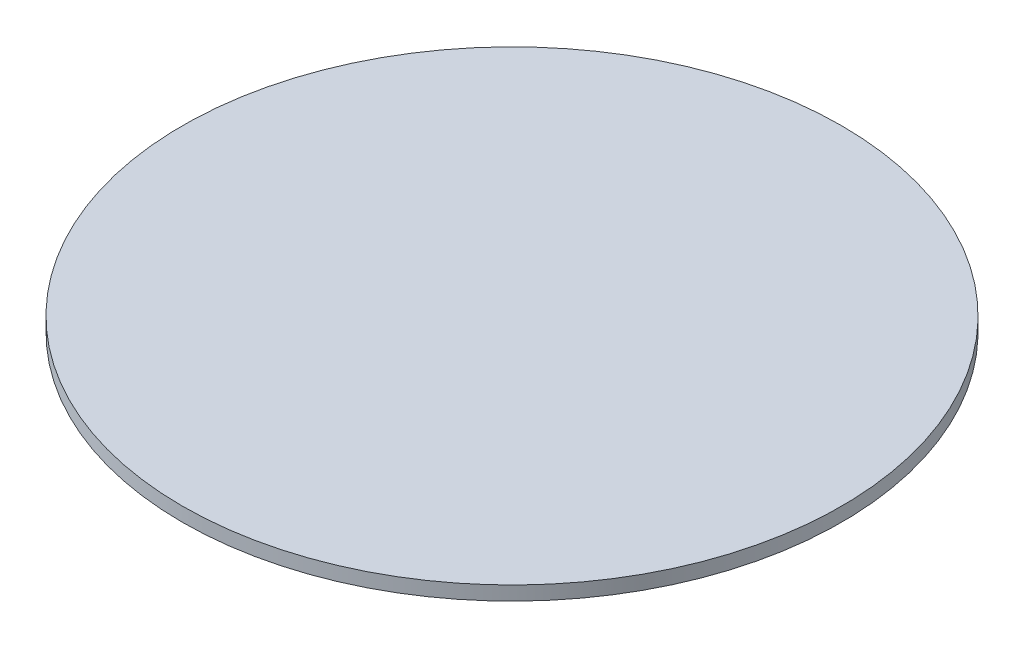
ISO-10303-21;
HEADER;
FILE_DESCRIPTION(('STEP AP214'),'2;1');
FILE_NAME('part.step','',(''),(''),'','','');
FILE_SCHEMA(('AUTOMOTIVE_DESIGN { 1 0 10303 214 1 1 1 1 }'));
ENDSEC;
DATA;
#1=APPLICATION_CONTEXT('core data for automotive mechanical design processes');
#2=APPLICATION_PROTOCOL_DEFINITION('international standard','automotive_design',2000,#1);
#3=PRODUCT_CONTEXT('',#1,'mechanical');
#4=PRODUCT('Part','Part','',(#3));
#5=PRODUCT_RELATED_PRODUCT_CATEGORY('part','',(#4));
#6=PRODUCT_DEFINITION_FORMATION('','',#4);
#7=PRODUCT_DEFINITION_CONTEXT('part definition',#1,'design');
#8=PRODUCT_DEFINITION('design','',#6,#7);
#9=PRODUCT_DEFINITION_SHAPE('','',#8);
#10=(LENGTH_UNIT() NAMED_UNIT(*) SI_UNIT(.MILLI.,.METRE.));
#11=(NAMED_UNIT(*) PLANE_ANGLE_UNIT() SI_UNIT($,.RADIAN.));
#12=(NAMED_UNIT(*) SI_UNIT($,.STERADIAN.) SOLID_ANGLE_UNIT());
#13=UNCERTAINTY_MEASURE_WITH_UNIT(LENGTH_MEASURE(1.E-05),#10,'distance_accuracy_value','');
#14=(GEOMETRIC_REPRESENTATION_CONTEXT(3) GLOBAL_UNCERTAINTY_ASSIGNED_CONTEXT((#13)) GLOBAL_UNIT_ASSIGNED_CONTEXT((#10,
#11,#12)) REPRESENTATION_CONTEXT('',''));
#15=CARTESIAN_POINT('',(0.,0.,0.));
#16=DIRECTION('',(0.,0.,1.));
#17=DIRECTION('',(1.,0.,0.));
#18=AXIS2_PLACEMENT_3D('',#15,#16,#17);
#19=CARTESIAN_POINT('',(0.,1.4875,0.));
#20=DIRECTION('',(0.,-1.,0.));
#21=DIRECTION('',(0.,0.,-1.));
#22=AXIS2_PLACEMENT_3D('',#19,#20,#21);
#23=CYLINDRICAL_SURFACE('',#22,30.);
#24=CARTESIAN_POINT('',(0.,1.4875,0.));
#25=DIRECTION('',(0.,1.,0.));
#26=DIRECTION('',(0.,0.,1.));
#27=AXIS2_PLACEMENT_3D('',#24,#25,#26);
#28=CIRCLE('',#27,30.);
#29=CARTESIAN_POINT('',(0.,1.4875,30.));
#30=VERTEX_POINT('',#29);
#31=EDGE_CURVE('E10',#30,#30,#28,.T.);
#32=ORIENTED_EDGE('',*,*,#31,.F.);
#33=EDGE_LOOP('',(#32));
#34=FACE_BOUND('',#33,.T.);
#35=CARTESIAN_POINT('',(0.,0.2125,0.));
#36=DIRECTION('',(0.,1.,0.));
#37=DIRECTION('',(0.,0.,1.));
#38=AXIS2_PLACEMENT_3D('',#35,#36,#37);
#39=CIRCLE('',#38,30.);
#40=CARTESIAN_POINT('',(0.,0.2125,30.));
#41=VERTEX_POINT('',#40);
#42=EDGE_CURVE('E36',#41,#41,#39,.T.);
#43=ORIENTED_EDGE('',*,*,#42,.T.);
#44=EDGE_LOOP('',(#43));
#45=FACE_BOUND('',#44,.T.);
#46=ADVANCED_FACE('F33',(#34,#45),#23,.T.);
#47=CARTESIAN_POINT('',(0.,1.4875,0.));
#48=DIRECTION('',(0.,1.,0.));
#49=DIRECTION('',(0.,0.,1.));
#50=AXIS2_PLACEMENT_3D('',#47,#48,#49);
#51=PLANE('',#50);
#52=ORIENTED_EDGE('',*,*,#31,.T.);
#53=EDGE_LOOP('',(#52));
#54=FACE_BOUND('',#53,.T.);
#55=ADVANCED_FACE('F48',(#54),#51,.T.);
#56=CARTESIAN_POINT('',(0.,0.2125,0.));
#57=DIRECTION('',(0.,1.,0.));
#58=DIRECTION('',(0.,0.,1.));
#59=AXIS2_PLACEMENT_3D('',#56,#57,#58);
#60=PLANE('',#59);
#61=ORIENTED_EDGE('',*,*,#42,.F.);
#62=EDGE_LOOP('',(#61));
#63=FACE_BOUND('',#62,.T.);
#64=ADVANCED_FACE('F46',(#63),#60,.F.);
#65=CLOSED_SHELL('',(#46,#55,#64));
#66=MANIFOLD_SOLID_BREP('B2',#65);
#67=ADVANCED_BREP_SHAPE_REPRESENTATION('',(#18,#66),#14);
#68=SHAPE_DEFINITION_REPRESENTATION(#9,#67);
ENDSEC;
END-ISO-10303-21;
